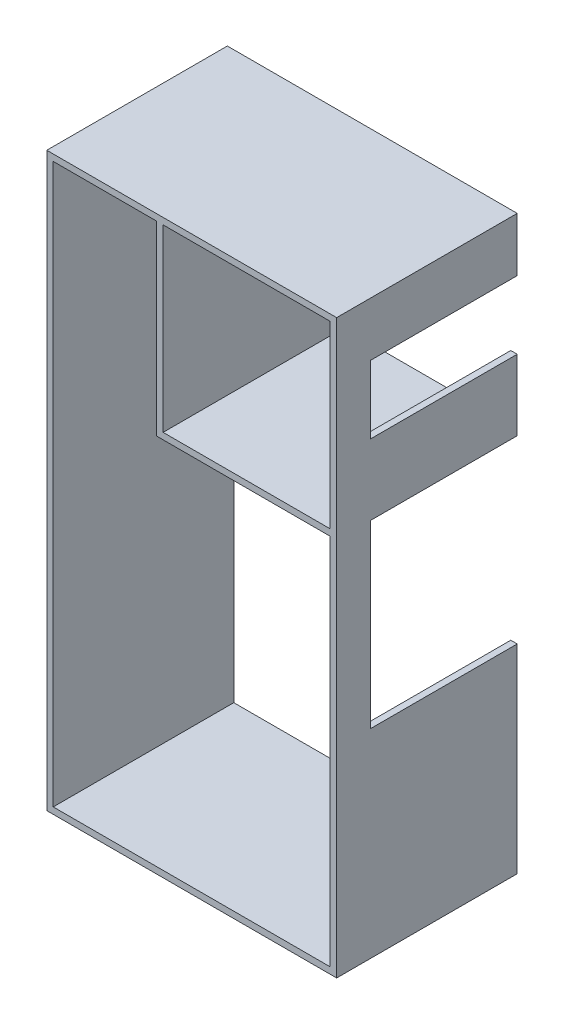
ISO-10303-21;
HEADER;
FILE_DESCRIPTION(('STEP AP214'),'2;1');
FILE_NAME('part.step','',(''),(''),'','','');
FILE_SCHEMA(('AUTOMOTIVE_DESIGN { 1 0 10303 214 1 1 1 1 }'));
ENDSEC;
DATA;
#1=APPLICATION_CONTEXT('core data for automotive mechanical design processes');
#2=APPLICATION_PROTOCOL_DEFINITION('international standard','automotive_design',2000,#1);
#3=PRODUCT_CONTEXT('',#1,'mechanical');
#4=PRODUCT('Part','Part','',(#3));
#5=PRODUCT_RELATED_PRODUCT_CATEGORY('part','',(#4));
#6=PRODUCT_DEFINITION_FORMATION('','',#4);
#7=PRODUCT_DEFINITION_CONTEXT('part definition',#1,'design');
#8=PRODUCT_DEFINITION('design','',#6,#7);
#9=PRODUCT_DEFINITION_SHAPE('','',#8);
#10=(LENGTH_UNIT() NAMED_UNIT(*) SI_UNIT(.MILLI.,.METRE.));
#11=(NAMED_UNIT(*) PLANE_ANGLE_UNIT() SI_UNIT($,.RADIAN.));
#12=(NAMED_UNIT(*) SI_UNIT($,.STERADIAN.) SOLID_ANGLE_UNIT());
#13=UNCERTAINTY_MEASURE_WITH_UNIT(LENGTH_MEASURE(1.E-05),#10,'distance_accuracy_value','');
#14=(GEOMETRIC_REPRESENTATION_CONTEXT(3) GLOBAL_UNCERTAINTY_ASSIGNED_CONTEXT((#13)) GLOBAL_UNIT_ASSIGNED_CONTEXT((#10,
#11,#12)) REPRESENTATION_CONTEXT('',''));
#15=CARTESIAN_POINT('',(0.,0.,0.));
#16=DIRECTION('',(0.,0.,1.));
#17=DIRECTION('',(1.,0.,0.));
#18=AXIS2_PLACEMENT_3D('',#15,#16,#17);
#19=CARTESIAN_POINT('',(-29656.4025133184,0.,41671.7001960568));
#20=DIRECTION('',(1.,0.,0.));
#21=DIRECTION('',(0.,0.,-1.));
#22=AXIS2_PLACEMENT_3D('',#19,#20,#21);
#23=PLANE('',#22);
#24=DIRECTION('',(0.,0.,1.));
#25=VECTOR('',#24,1.);
#26=CARTESIAN_POINT('',(-29656.4025133184,10080.7536432934,41671.7001960568));
#27=LINE('',#26,#25);
#28=CARTESIAN_POINT('',(-29656.4025133184,10080.7536432934,41150.2646912607));
#29=VERTEX_POINT('',#28);
#30=CARTESIAN_POINT('',(-29656.4025133184,10080.7536432934,41671.7001960568));
#31=VERTEX_POINT('',#30);
#32=EDGE_CURVE('E291',#29,#31,#27,.T.);
#33=ORIENTED_EDGE('',*,*,#32,.F.);
#34=DIRECTION('',(0.,-1.,0.));
#35=VECTOR('',#34,1.);
#36=CARTESIAN_POINT('',(-29656.4025133184,0.,41150.2646912607));
#37=LINE('',#36,#35);
#38=CARTESIAN_POINT('',(-29656.4025133184,7285.00682802414,41150.2646912607));
#39=VERTEX_POINT('',#38);
#40=EDGE_CURVE('E378',#29,#39,#37,.T.);
#41=ORIENTED_EDGE('',*,*,#40,.T.);
#42=DIRECTION('',(0.,0.,-1.));
#43=VECTOR('',#42,1.);
#44=CARTESIAN_POINT('',(-29656.4025133184,7285.00682802414,41671.7001960568));
#45=LINE('',#44,#43);
#46=CARTESIAN_POINT('',(-29656.4025133184,7285.00682802414,38871.7001960568));
#47=VERTEX_POINT('',#46);
#48=EDGE_CURVE('E375',#39,#47,#45,.T.);
#49=ORIENTED_EDGE('',*,*,#48,.T.);
#50=DIRECTION('',(0.,-1.,0.));
#51=VECTOR('',#50,1.);
#52=CARTESIAN_POINT('',(-29656.4025133184,0.,38871.7001960568));
#53=LINE('',#52,#51);
#54=CARTESIAN_POINT('',(-29656.4025133184,4298.5625694867,38871.7001960568));
#55=VERTEX_POINT('',#54);
#56=EDGE_CURVE('E323',#47,#55,#53,.T.);
#57=ORIENTED_EDGE('',*,*,#56,.T.);
#58=DIRECTION('',(0.,0.,-1.));
#59=VECTOR('',#58,1.);
#60=CARTESIAN_POINT('',(-29656.4025133184,4298.5625694867,41671.7001960568));
#61=LINE('',#60,#59);
#62=CARTESIAN_POINT('',(-29656.4025133184,4298.5625694867,41671.7001960568));
#63=VERTEX_POINT('',#62);
#64=EDGE_CURVE('E336',#63,#55,#61,.T.);
#65=ORIENTED_EDGE('',*,*,#64,.F.);
#66=DIRECTION('',(0.,-1.,0.));
#67=VECTOR('',#66,1.);
#68=CARTESIAN_POINT('',(-29656.4025133184,0.,41671.7001960568));
#69=LINE('',#68,#67);
#70=EDGE_CURVE('E108',#31,#63,#69,.T.);
#71=ORIENTED_EDGE('',*,*,#70,.F.);
#72=EDGE_LOOP('',(#33,#41,#49,#57,#65,#71));
#73=FACE_BOUND('',#72,.T.);
#74=ADVANCED_FACE('F85',(#73),#23,.F.);
#75=CARTESIAN_POINT('',(0.,12967.481366586,41671.7001960568));
#76=DIRECTION('',(0.,1.,0.));
#77=DIRECTION('',(0.,0.,1.));
#78=AXIS2_PLACEMENT_3D('',#75,#76,#77);
#79=PLANE('',#78);
#80=DIRECTION('',(0.,0.,-1.));
#81=VECTOR('',#80,1.);
#82=CARTESIAN_POINT('',(-32347.6899606535,12967.481366586,41671.7001960568));
#83=LINE('',#82,#81);
#84=CARTESIAN_POINT('',(-32347.6899606535,12967.481366586,41671.7001960568));
#85=VERTEX_POINT('',#84);
#86=CARTESIAN_POINT('',(-32347.6899606535,12967.481366586,38871.7001960568));
#87=VERTEX_POINT('',#86);
#88=EDGE_CURVE('E383',#85,#87,#83,.T.);
#89=ORIENTED_EDGE('',*,*,#88,.F.);
#90=DIRECTION('',(1.,0.,0.));
#91=VECTOR('',#90,1.);
#92=CARTESIAN_POINT('',(0.,12967.481366586,41671.7001960568));
#93=LINE('',#92,#91);
#94=CARTESIAN_POINT('',(-33951.6176832913,12967.481366586,41671.7001960568));
#95=VERTEX_POINT('',#94);
#96=EDGE_CURVE('E314',#95,#85,#93,.T.);
#97=ORIENTED_EDGE('',*,*,#96,.F.);
#98=DIRECTION('',(0.,0.,-1.));
#99=VECTOR('',#98,1.);
#100=CARTESIAN_POINT('',(-33951.6176832913,12967.481366586,41671.7001960568));
#101=LINE('',#100,#99);
#102=CARTESIAN_POINT('',(-33951.6176832913,12967.481366586,38871.7001960568));
#103=VERTEX_POINT('',#102);
#104=EDGE_CURVE('E317',#95,#103,#101,.T.);
#105=ORIENTED_EDGE('',*,*,#104,.T.);
#106=DIRECTION('',(1.,0.,0.));
#107=VECTOR('',#106,1.);
#108=CARTESIAN_POINT('',(0.,12967.481366586,38871.7001960568));
#109=LINE('',#108,#107);
#110=EDGE_CURVE('E307',#103,#87,#109,.T.);
#111=ORIENTED_EDGE('',*,*,#110,.T.);
#112=EDGE_LOOP('',(#89,#97,#105,#111));
#113=FACE_BOUND('',#112,.T.);
#114=ADVANCED_FACE('F424',(#113),#79,.F.);
#115=CARTESIAN_POINT('',(-29826.4025133184,0.,41150.2646912607));
#116=DIRECTION('',(0.,0.,1.));
#117=DIRECTION('',(1.,0.,0.));
#118=AXIS2_PLACEMENT_3D('',#115,#116,#117);
#119=PLANE('',#118);
#120=DIRECTION('',(-1.,0.,0.));
#121=VECTOR('',#120,1.);
#122=CARTESIAN_POINT('',(-29826.4025133184,10080.7536432934,41150.2646912607));
#123=LINE('',#122,#121);
#124=CARTESIAN_POINT('',(-29556.4025133184,10080.7536432934,41150.2646912607));
#125=VERTEX_POINT('',#124);
#126=EDGE_CURVE('E380',#125,#29,#123,.T.);
#127=ORIENTED_EDGE('',*,*,#126,.F.);
#128=DIRECTION('',(0.,-1.,0.));
#129=VECTOR('',#128,1.);
#130=CARTESIAN_POINT('',(-29556.4025133184,0.,41150.2646912607));
#131=LINE('',#130,#129);
#132=CARTESIAN_POINT('',(-29556.4025133184,7285.00682802414,41150.2646912607));
#133=VERTEX_POINT('',#132);
#134=EDGE_CURVE('E293',#125,#133,#131,.T.);
#135=ORIENTED_EDGE('',*,*,#134,.T.);
#136=DIRECTION('',(1.,0.,0.));
#137=VECTOR('',#136,1.);
#138=CARTESIAN_POINT('',(-29826.4025133184,7285.00682802414,41150.2646912607));
#139=LINE('',#138,#137);
#140=EDGE_CURVE('E297',#39,#133,#139,.T.);
#141=ORIENTED_EDGE('',*,*,#140,.F.);
#142=ORIENTED_EDGE('',*,*,#40,.F.);
#143=EDGE_LOOP('',(#127,#135,#141,#142));
#144=FACE_BOUND('',#143,.T.);
#145=ADVANCED_FACE('F464',(#144),#119,.F.);
#146=CARTESIAN_POINT('',(0.,0.,38871.7001960568));
#147=DIRECTION('',(0.,0.,1.));
#148=DIRECTION('',(1.,0.,0.));
#149=AXIS2_PLACEMENT_3D('',#146,#147,#148);
#150=PLANE('',#149);
#151=DIRECTION('',(0.,-1.,0.));
#152=VECTOR('',#151,1.);
#153=CARTESIAN_POINT('',(-29556.4025133184,0.,38871.7001960568));
#154=LINE('',#153,#152);
#155=CARTESIAN_POINT('',(-29556.4025133184,13067.481366586,38871.7001960568));
#156=VERTEX_POINT('',#155);
#157=CARTESIAN_POINT('',(-29556.4025133184,12230.8473890307,38871.7001960568));
#158=VERTEX_POINT('',#157);
#159=EDGE_CURVE('E361',#156,#158,#154,.T.);
#160=ORIENTED_EDGE('',*,*,#159,.T.);
#161=DIRECTION('',(1.,0.,0.));
#162=VECTOR('',#161,1.);
#163=CARTESIAN_POINT('',(-29696.4025133184,12230.8473890307,38871.7001960568));
#164=LINE('',#163,#162);
#165=CARTESIAN_POINT('',(-29656.4025133184,12230.8473890307,38871.7001960568));
#166=VERTEX_POINT('',#165);
#167=EDGE_CURVE('E254',#166,#158,#164,.T.);
#168=ORIENTED_EDGE('',*,*,#167,.F.);
#169=CARTESIAN_POINT('',(-29656.4025133184,12967.481366586,38871.7001960568));
#170=VERTEX_POINT('',#169);
#171=EDGE_CURVE('E324',#170,#166,#53,.T.);
#172=ORIENTED_EDGE('',*,*,#171,.F.);
#173=CARTESIAN_POINT('',(-32247.6899606535,12967.481366586,38871.7001960568));
#174=VERTEX_POINT('',#173);
#175=EDGE_CURVE('E327',#174,#170,#109,.T.);
#176=ORIENTED_EDGE('',*,*,#175,.F.);
#177=DIRECTION('',(0.,-1.,0.));
#178=VECTOR('',#177,1.);
#179=CARTESIAN_POINT('',(-32247.6899606535,0.,38871.7001960568));
#180=LINE('',#179,#178);
#181=CARTESIAN_POINT('',(-32247.6899606535,10180.7536432934,38871.7001960568));
#182=VERTEX_POINT('',#181);
#183=EDGE_CURVE('E264',#174,#182,#180,.T.);
#184=ORIENTED_EDGE('',*,*,#183,.T.);
#185=DIRECTION('',(1.,0.,0.));
#186=VECTOR('',#185,1.);
#187=CARTESIAN_POINT('',(0.,10180.7536432934,38871.7001960568));
#188=LINE('',#187,#186);
#189=CARTESIAN_POINT('',(-29656.4025133184,10180.7536432934,38871.7001960568));
#190=VERTEX_POINT('',#189);
#191=EDGE_CURVE('E267',#182,#190,#188,.T.);
#192=ORIENTED_EDGE('',*,*,#191,.T.);
#193=CARTESIAN_POINT('',(-29656.4025133184,11175.8565330266,38871.7001960568));
#194=VERTEX_POINT('',#193);
#195=EDGE_CURVE('E328',#194,#190,#53,.T.);
#196=ORIENTED_EDGE('',*,*,#195,.F.);
#197=DIRECTION('',(1.,0.,0.));
#198=VECTOR('',#197,1.);
#199=CARTESIAN_POINT('',(-29696.4025133184,11175.8565330266,38871.7001960568));
#200=LINE('',#199,#198);
#201=CARTESIAN_POINT('',(-29556.4025133184,11175.8565330266,38871.7001960568));
#202=VERTEX_POINT('',#201);
#203=EDGE_CURVE('E100',#194,#202,#200,.T.);
#204=ORIENTED_EDGE('',*,*,#203,.T.);
#205=CARTESIAN_POINT('',(-29556.4025133184,10080.7536432934,38871.7001960568));
#206=VERTEX_POINT('',#205);
#207=EDGE_CURVE('E248',#202,#206,#154,.T.);
#208=ORIENTED_EDGE('',*,*,#207,.T.);
#209=DIRECTION('',(1.,0.,0.));
#210=VECTOR('',#209,1.);
#211=CARTESIAN_POINT('',(-29556.4025133184,10080.7536432934,38871.7001960568));
#212=LINE('',#211,#210);
#213=CARTESIAN_POINT('',(-32347.6899606535,10080.7536432934,38871.7001960568));
#214=VERTEX_POINT('',#213);
#215=EDGE_CURVE('E280',#214,#206,#212,.T.);
#216=ORIENTED_EDGE('',*,*,#215,.F.);
#217=DIRECTION('',(0.,-1.,0.));
#218=VECTOR('',#217,1.);
#219=CARTESIAN_POINT('',(-32347.6899606535,13067.481366586,38871.7001960568));
#220=LINE('',#219,#218);
#221=EDGE_CURVE('E278',#87,#214,#220,.T.);
#222=ORIENTED_EDGE('',*,*,#221,.F.);
#223=ORIENTED_EDGE('',*,*,#110,.F.);
#224=DIRECTION('',(0.,-1.,0.));
#225=VECTOR('',#224,1.);
#226=CARTESIAN_POINT('',(-33951.6176832913,0.,38871.7001960568));
#227=LINE('',#226,#225);
#228=CARTESIAN_POINT('',(-33951.6176832913,4298.5625694867,38871.7001960568));
#229=VERTEX_POINT('',#228);
#230=EDGE_CURVE('E301',#103,#229,#227,.T.);
#231=ORIENTED_EDGE('',*,*,#230,.T.);
#232=DIRECTION('',(1.,0.,0.));
#233=VECTOR('',#232,1.);
#234=CARTESIAN_POINT('',(0.,4298.5625694867,38871.7001960568));
#235=LINE('',#234,#233);
#236=EDGE_CURVE('E320',#229,#55,#235,.T.);
#237=ORIENTED_EDGE('',*,*,#236,.T.);
#238=ORIENTED_EDGE('',*,*,#56,.F.);
#239=DIRECTION('',(1.,0.,0.));
#240=VECTOR('',#239,1.);
#241=CARTESIAN_POINT('',(-29826.4025133184,7285.00682802414,38871.7001960568));
#242=LINE('',#241,#240);
#243=CARTESIAN_POINT('',(-29556.4025133184,7285.00682802414,38871.7001960568));
#244=VERTEX_POINT('',#243);
#245=EDGE_CURVE('E298',#47,#244,#242,.T.);
#246=ORIENTED_EDGE('',*,*,#245,.T.);
#247=CARTESIAN_POINT('',(-29556.4025133184,4198.56256948671,38871.7001960568));
#248=VERTEX_POINT('',#247);
#249=EDGE_CURVE('E360',#244,#248,#154,.T.);
#250=ORIENTED_EDGE('',*,*,#249,.T.);
#251=DIRECTION('',(1.,0.,0.));
#252=VECTOR('',#251,1.);
#253=CARTESIAN_POINT('',(0.,4198.56256948671,38871.7001960568));
#254=LINE('',#253,#252);
#255=CARTESIAN_POINT('',(-34051.6176832913,4198.56256948671,38871.7001960568));
#256=VERTEX_POINT('',#255);
#257=EDGE_CURVE('E357',#256,#248,#254,.T.);
#258=ORIENTED_EDGE('',*,*,#257,.F.);
#259=DIRECTION('',(0.,-1.,0.));
#260=VECTOR('',#259,1.);
#261=CARTESIAN_POINT('',(-34051.6176832913,0.,38871.7001960568));
#262=LINE('',#261,#260);
#263=CARTESIAN_POINT('',(-34051.6176832913,13067.481366586,38871.7001960568));
#264=VERTEX_POINT('',#263);
#265=EDGE_CURVE('E342',#264,#256,#262,.T.);
#266=ORIENTED_EDGE('',*,*,#265,.F.);
#267=DIRECTION('',(1.,0.,0.));
#268=VECTOR('',#267,1.);
#269=CARTESIAN_POINT('',(0.,13067.481366586,38871.7001960568));
#270=LINE('',#269,#268);
#271=EDGE_CURVE('E347',#264,#156,#270,.T.);
#272=ORIENTED_EDGE('',*,*,#271,.T.);
#273=EDGE_LOOP('',(#160,#168,#172,#176,#184,#192,#196,#204,#208,#216,#222,#223,#231,#237,#238,
#246,#250,#258,#266,#272));
#274=FACE_BOUND('',#273,.T.);
#275=ADVANCED_FACE('F394',(#274),#150,.F.);
#276=CARTESIAN_POINT('',(-29556.4025133184,0.,41671.7001960568));
#277=DIRECTION('',(1.,0.,0.));
#278=DIRECTION('',(0.,0.,-1.));
#279=AXIS2_PLACEMENT_3D('',#276,#277,#278);
#280=PLANE('',#279);
#281=DIRECTION('',(0.,0.,1.));
#282=VECTOR('',#281,1.);
#283=CARTESIAN_POINT('',(-29556.4025133184,12230.8473890307,41150.2646912607));
#284=LINE('',#283,#282);
#285=CARTESIAN_POINT('',(-29556.4025133184,12230.8473890307,41150.2646912607));
#286=VERTEX_POINT('',#285);
#287=EDGE_CURVE('E234',#158,#286,#284,.T.);
#288=ORIENTED_EDGE('',*,*,#287,.F.);
#289=ORIENTED_EDGE('',*,*,#159,.F.);
#290=DIRECTION('',(0.,0.,-1.));
#291=VECTOR('',#290,1.);
#292=CARTESIAN_POINT('',(-29556.4025133184,13067.481366586,41671.7001960568));
#293=LINE('',#292,#291);
#294=CARTESIAN_POINT('',(-29556.4025133184,13067.481366586,41671.7001960568));
#295=VERTEX_POINT('',#294);
#296=EDGE_CURVE('E366',#295,#156,#293,.T.);
#297=ORIENTED_EDGE('',*,*,#296,.F.);
#298=DIRECTION('',(0.,-1.,0.));
#299=VECTOR('',#298,1.);
#300=CARTESIAN_POINT('',(-29556.4025133184,0.,41671.7001960568));
#301=LINE('',#300,#299);
#302=CARTESIAN_POINT('',(-29556.4025133184,4198.56256948671,41671.7001960568));
#303=VERTEX_POINT('',#302);
#304=EDGE_CURVE('E350',#295,#303,#301,.T.);
#305=ORIENTED_EDGE('',*,*,#304,.T.);
#306=DIRECTION('',(0.,0.,-1.));
#307=VECTOR('',#306,1.);
#308=CARTESIAN_POINT('',(-29556.4025133184,4198.56256948671,41671.7001960568));
#309=LINE('',#308,#307);
#310=EDGE_CURVE('E369',#303,#248,#309,.T.);
#311=ORIENTED_EDGE('',*,*,#310,.T.);
#312=ORIENTED_EDGE('',*,*,#249,.F.);
#313=DIRECTION('',(0.,0.,-1.));
#314=VECTOR('',#313,1.);
#315=CARTESIAN_POINT('',(-29556.4025133184,7285.00682802414,0.));
#316=LINE('',#315,#314);
#317=EDGE_CURVE('E295',#133,#244,#316,.T.);
#318=ORIENTED_EDGE('',*,*,#317,.F.);
#319=ORIENTED_EDGE('',*,*,#134,.F.);
#320=DIRECTION('',(0.,0.,-1.));
#321=VECTOR('',#320,1.);
#322=CARTESIAN_POINT('',(-29556.4025133184,10080.7536432934,45759.7104830712));
#323=LINE('',#322,#321);
#324=EDGE_CURVE('E283',#125,#206,#323,.T.);
#325=ORIENTED_EDGE('',*,*,#324,.T.);
#326=ORIENTED_EDGE('',*,*,#207,.F.);
#327=DIRECTION('',(0.,0.,-1.));
#328=VECTOR('',#327,1.);
#329=CARTESIAN_POINT('',(-29556.4025133184,11175.8565330266,41150.2646912607));
#330=LINE('',#329,#328);
#331=CARTESIAN_POINT('',(-29556.4025133184,11175.8565330266,41150.2646912607));
#332=VERTEX_POINT('',#331);
#333=EDGE_CURVE('E230',#332,#202,#330,.T.);
#334=ORIENTED_EDGE('',*,*,#333,.F.);
#335=DIRECTION('',(0.,-1.,0.));
#336=VECTOR('',#335,1.);
#337=CARTESIAN_POINT('',(-29556.4025133184,11175.8565330266,41150.2646912607));
#338=LINE('',#337,#336);
#339=EDGE_CURVE('E237',#286,#332,#338,.T.);
#340=ORIENTED_EDGE('',*,*,#339,.F.);
#341=EDGE_LOOP('',(#288,#289,#297,#305,#311,#312,#318,#319,#325,#326,#334,#340));
#342=FACE_BOUND('',#341,.T.);
#343=ADVANCED_FACE('F246',(#342),#280,.T.);
#344=ORIENTED_EDGE('',*,*,#171,.T.);
#345=DIRECTION('',(0.,0.,1.));
#346=VECTOR('',#345,1.);
#347=CARTESIAN_POINT('',(-29656.4025133184,12230.8473890307,41671.7001960568));
#348=LINE('',#347,#346);
#349=CARTESIAN_POINT('',(-29656.4025133184,12230.8473890307,41150.2646912607));
#350=VERTEX_POINT('',#349);
#351=EDGE_CURVE('E12',#166,#350,#348,.T.);
#352=ORIENTED_EDGE('',*,*,#351,.T.);
#353=DIRECTION('',(0.,-1.,0.));
#354=VECTOR('',#353,1.);
#355=CARTESIAN_POINT('',(-29656.4025133184,0.,41150.2646912607));
#356=LINE('',#355,#354);
#357=CARTESIAN_POINT('',(-29656.4025133184,11175.8565330266,41150.2646912607));
#358=VERTEX_POINT('',#357);
#359=EDGE_CURVE('E93',#350,#358,#356,.T.);
#360=ORIENTED_EDGE('',*,*,#359,.T.);
#361=DIRECTION('',(0.,0.,-1.));
#362=VECTOR('',#361,1.);
#363=CARTESIAN_POINT('',(-29656.4025133184,11175.8565330266,41671.7001960568));
#364=LINE('',#363,#362);
#365=EDGE_CURVE('E231',#358,#194,#364,.T.);
#366=ORIENTED_EDGE('',*,*,#365,.T.);
#367=ORIENTED_EDGE('',*,*,#195,.T.);
#368=DIRECTION('',(0.,0.,-1.));
#369=VECTOR('',#368,1.);
#370=CARTESIAN_POINT('',(-29656.4025133184,10180.7536432934,45759.7104830712));
#371=LINE('',#370,#369);
#372=CARTESIAN_POINT('',(-29656.4025133184,10180.7536432934,41671.7001960568));
#373=VERTEX_POINT('',#372);
#374=EDGE_CURVE('E270',#373,#190,#371,.T.);
#375=ORIENTED_EDGE('',*,*,#374,.F.);
#376=CARTESIAN_POINT('',(-29656.4025133184,12967.481366586,41671.7001960568));
#377=VERTEX_POINT('',#376);
#378=EDGE_CURVE('E310',#377,#373,#69,.T.);
#379=ORIENTED_EDGE('',*,*,#378,.F.);
#380=DIRECTION('',(0.,0.,-1.));
#381=VECTOR('',#380,1.);
#382=CARTESIAN_POINT('',(-29656.4025133184,12967.481366586,41671.7001960568));
#383=LINE('',#382,#381);
#384=EDGE_CURVE('E333',#377,#170,#383,.T.);
#385=ORIENTED_EDGE('',*,*,#384,.T.);
#386=EDGE_LOOP('',(#344,#352,#360,#366,#367,#375,#379,#385));
#387=FACE_BOUND('',#386,.T.);
#388=ADVANCED_FACE('F386',(#387),#23,.F.);
#389=CARTESIAN_POINT('',(0.,0.,41671.7001960568));
#390=DIRECTION('',(0.,0.,1.));
#391=DIRECTION('',(1.,0.,0.));
#392=AXIS2_PLACEMENT_3D('',#389,#390,#391);
#393=PLANE('',#392);
#394=DIRECTION('',(1.,0.,0.));
#395=VECTOR('',#394,1.);
#396=CARTESIAN_POINT('',(-29556.4025133184,10080.7536432934,41671.7001960568));
#397=LINE('',#396,#395);
#398=CARTESIAN_POINT('',(-32347.6899606535,10080.7536432934,41671.7001960568));
#399=VERTEX_POINT('',#398);
#400=EDGE_CURVE('E259',#399,#31,#397,.T.);
#401=ORIENTED_EDGE('',*,*,#400,.T.);
#402=ORIENTED_EDGE('',*,*,#70,.T.);
#403=DIRECTION('',(1.,0.,0.));
#404=VECTOR('',#403,1.);
#405=CARTESIAN_POINT('',(0.,4298.5625694867,41671.7001960568));
#406=LINE('',#405,#404);
#407=CARTESIAN_POINT('',(-33951.6176832913,4298.5625694867,41671.7001960568));
#408=VERTEX_POINT('',#407);
#409=EDGE_CURVE('E306',#408,#63,#406,.T.);
#410=ORIENTED_EDGE('',*,*,#409,.F.);
#411=DIRECTION('',(0.,-1.,0.));
#412=VECTOR('',#411,1.);
#413=CARTESIAN_POINT('',(-33951.6176832913,0.,41671.7001960568));
#414=LINE('',#413,#412);
#415=EDGE_CURVE('E304',#95,#408,#414,.T.);
#416=ORIENTED_EDGE('',*,*,#415,.F.);
#417=ORIENTED_EDGE('',*,*,#96,.T.);
#418=DIRECTION('',(0.,-1.,0.));
#419=VECTOR('',#418,1.);
#420=CARTESIAN_POINT('',(-32347.6899606535,13067.481366586,41671.7001960568));
#421=LINE('',#420,#419);
#422=EDGE_CURVE('E262',#85,#399,#421,.T.);
#423=ORIENTED_EDGE('',*,*,#422,.T.);
#424=EDGE_LOOP('',(#401,#402,#410,#416,#417,#423));
#425=FACE_BOUND('',#424,.T.);
#426=ORIENTED_EDGE('',*,*,#378,.T.);
#427=DIRECTION('',(1.,0.,0.));
#428=VECTOR('',#427,1.);
#429=CARTESIAN_POINT('',(0.,10180.7536432934,41671.7001960568));
#430=LINE('',#429,#428);
#431=CARTESIAN_POINT('',(-32247.6899606535,10180.7536432934,41671.7001960568));
#432=VERTEX_POINT('',#431);
#433=EDGE_CURVE('E288',#432,#373,#430,.T.);
#434=ORIENTED_EDGE('',*,*,#433,.F.);
#435=DIRECTION('',(0.,-1.,0.));
#436=VECTOR('',#435,1.);
#437=CARTESIAN_POINT('',(-32247.6899606535,0.,41671.7001960568));
#438=LINE('',#437,#436);
#439=CARTESIAN_POINT('',(-32247.6899606535,12967.481366586,41671.7001960568));
#440=VERTEX_POINT('',#439);
#441=EDGE_CURVE('E253',#440,#432,#438,.T.);
#442=ORIENTED_EDGE('',*,*,#441,.F.);
#443=EDGE_CURVE('E313',#440,#377,#93,.T.);
#444=ORIENTED_EDGE('',*,*,#443,.T.);
#445=EDGE_LOOP('',(#426,#434,#442,#444));
#446=FACE_BOUND('',#445,.T.);
#447=DIRECTION('',(1.,0.,0.));
#448=VECTOR('',#447,1.);
#449=CARTESIAN_POINT('',(0.,4198.56256948671,41671.7001960568));
#450=LINE('',#449,#448);
#451=CARTESIAN_POINT('',(-34051.6176832913,4198.56256948671,41671.7001960568));
#452=VERTEX_POINT('',#451);
#453=EDGE_CURVE('E346',#452,#303,#450,.T.);
#454=ORIENTED_EDGE('',*,*,#453,.T.);
#455=ORIENTED_EDGE('',*,*,#304,.F.);
#456=DIRECTION('',(1.,0.,0.));
#457=VECTOR('',#456,1.);
#458=CARTESIAN_POINT('',(0.,13067.481366586,41671.7001960568));
#459=LINE('',#458,#457);
#460=CARTESIAN_POINT('',(-34051.6176832913,13067.481366586,41671.7001960568));
#461=VERTEX_POINT('',#460);
#462=EDGE_CURVE('E352',#461,#295,#459,.T.);
#463=ORIENTED_EDGE('',*,*,#462,.F.);
#464=DIRECTION('',(0.,-1.,0.));
#465=VECTOR('',#464,1.);
#466=CARTESIAN_POINT('',(-34051.6176832913,0.,41671.7001960568));
#467=LINE('',#466,#465);
#468=EDGE_CURVE('E343',#461,#452,#467,.T.);
#469=ORIENTED_EDGE('',*,*,#468,.T.);
#470=EDGE_LOOP('',(#454,#455,#463,#469));
#471=FACE_BOUND('',#470,.T.);
#472=ADVANCED_FACE('F403',(#425,#446,#471),#393,.T.);
#473=CARTESIAN_POINT('',(-34051.6176832913,0.,41671.7001960568));
#474=DIRECTION('',(1.,0.,0.));
#475=DIRECTION('',(0.,0.,-1.));
#476=AXIS2_PLACEMENT_3D('',#473,#474,#475);
#477=PLANE('',#476);
#478=ORIENTED_EDGE('',*,*,#265,.T.);
#479=DIRECTION('',(0.,0.,-1.));
#480=VECTOR('',#479,1.);
#481=CARTESIAN_POINT('',(-34051.6176832913,4198.56256948671,41671.7001960568));
#482=LINE('',#481,#480);
#483=EDGE_CURVE('E372',#452,#256,#482,.T.);
#484=ORIENTED_EDGE('',*,*,#483,.F.);
#485=ORIENTED_EDGE('',*,*,#468,.F.);
#486=DIRECTION('',(0.,0.,-1.));
#487=VECTOR('',#486,1.);
#488=CARTESIAN_POINT('',(-34051.6176832913,13067.481366586,41671.7001960568));
#489=LINE('',#488,#487);
#490=EDGE_CURVE('E354',#461,#264,#489,.T.);
#491=ORIENTED_EDGE('',*,*,#490,.T.);
#492=EDGE_LOOP('',(#478,#484,#485,#491));
#493=FACE_BOUND('',#492,.T.);
#494=ADVANCED_FACE('F87',(#493),#477,.F.);
#495=CARTESIAN_POINT('',(0.,4198.56256948671,41671.7001960568));
#496=DIRECTION('',(0.,1.,0.));
#497=DIRECTION('',(0.,0.,1.));
#498=AXIS2_PLACEMENT_3D('',#495,#496,#497);
#499=PLANE('',#498);
#500=ORIENTED_EDGE('',*,*,#257,.T.);
#501=ORIENTED_EDGE('',*,*,#310,.F.);
#502=ORIENTED_EDGE('',*,*,#453,.F.);
#503=ORIENTED_EDGE('',*,*,#483,.T.);
#504=EDGE_LOOP('',(#500,#501,#502,#503));
#505=FACE_BOUND('',#504,.T.);
#506=ADVANCED_FACE('F408',(#505),#499,.F.);
#507=CARTESIAN_POINT('',(0.,13067.481366586,41671.7001960568));
#508=DIRECTION('',(0.,1.,0.));
#509=DIRECTION('',(0.,0.,1.));
#510=AXIS2_PLACEMENT_3D('',#507,#508,#509);
#511=PLANE('',#510);
#512=ORIENTED_EDGE('',*,*,#296,.T.);
#513=ORIENTED_EDGE('',*,*,#271,.F.);
#514=ORIENTED_EDGE('',*,*,#490,.F.);
#515=ORIENTED_EDGE('',*,*,#462,.T.);
#516=EDGE_LOOP('',(#512,#513,#514,#515));
#517=FACE_BOUND('',#516,.T.);
#518=ADVANCED_FACE('F399',(#517),#511,.T.);
#519=CARTESIAN_POINT('',(-33951.6176832913,0.,41671.7001960568));
#520=DIRECTION('',(1.,0.,0.));
#521=DIRECTION('',(0.,0.,-1.));
#522=AXIS2_PLACEMENT_3D('',#519,#520,#521);
#523=PLANE('',#522);
#524=ORIENTED_EDGE('',*,*,#230,.F.);
#525=ORIENTED_EDGE('',*,*,#104,.F.);
#526=ORIENTED_EDGE('',*,*,#415,.T.);
#527=DIRECTION('',(0.,0.,-1.));
#528=VECTOR('',#527,1.);
#529=CARTESIAN_POINT('',(-33951.6176832913,4298.5625694867,41671.7001960568));
#530=LINE('',#529,#528);
#531=EDGE_CURVE('E339',#408,#229,#530,.T.);
#532=ORIENTED_EDGE('',*,*,#531,.T.);
#533=EDGE_LOOP('',(#524,#525,#526,#532));
#534=FACE_BOUND('',#533,.T.);
#535=ADVANCED_FACE('F428',(#534),#523,.T.);
#536=CARTESIAN_POINT('',(0.,4298.5625694867,41671.7001960568));
#537=DIRECTION('',(0.,1.,0.));
#538=DIRECTION('',(0.,0.,1.));
#539=AXIS2_PLACEMENT_3D('',#536,#537,#538);
#540=PLANE('',#539);
#541=ORIENTED_EDGE('',*,*,#236,.F.);
#542=ORIENTED_EDGE('',*,*,#531,.F.);
#543=ORIENTED_EDGE('',*,*,#409,.T.);
#544=ORIENTED_EDGE('',*,*,#64,.T.);
#545=EDGE_LOOP('',(#541,#542,#543,#544));
#546=FACE_BOUND('',#545,.T.);
#547=ADVANCED_FACE('F432',(#546),#540,.T.);
#548=ORIENTED_EDGE('',*,*,#443,.F.);
#549=DIRECTION('',(0.,0.,-1.));
#550=VECTOR('',#549,1.);
#551=CARTESIAN_POINT('',(-32247.6899606535,12967.481366586,45759.7104830712));
#552=LINE('',#551,#550);
#553=EDGE_CURVE('E275',#440,#174,#552,.T.);
#554=ORIENTED_EDGE('',*,*,#553,.T.);
#555=ORIENTED_EDGE('',*,*,#175,.T.);
#556=ORIENTED_EDGE('',*,*,#384,.F.);
#557=EDGE_LOOP('',(#548,#554,#555,#556));
#558=FACE_BOUND('',#557,.T.);
#559=ADVANCED_FACE('F446',(#558),#79,.F.);
#560=CARTESIAN_POINT('',(-29826.4025133184,7285.00682802414,0.));
#561=DIRECTION('',(0.,-1.,0.));
#562=DIRECTION('',(0.,0.,-1.));
#563=AXIS2_PLACEMENT_3D('',#560,#561,#562);
#564=PLANE('',#563);
#565=ORIENTED_EDGE('',*,*,#140,.T.);
#566=ORIENTED_EDGE('',*,*,#317,.T.);
#567=ORIENTED_EDGE('',*,*,#245,.F.);
#568=ORIENTED_EDGE('',*,*,#48,.F.);
#569=EDGE_LOOP('',(#565,#566,#567,#568));
#570=FACE_BOUND('',#569,.T.);
#571=ADVANCED_FACE('F489',(#570),#564,.F.);
#572=CARTESIAN_POINT('',(-29556.4025133184,10080.7536432934,45759.7104830712));
#573=DIRECTION('',(0.,1.,0.));
#574=DIRECTION('',(0.,0.,1.));
#575=AXIS2_PLACEMENT_3D('',#572,#573,#574);
#576=PLANE('',#575);
#577=ORIENTED_EDGE('',*,*,#126,.T.);
#578=ORIENTED_EDGE('',*,*,#32,.T.);
#579=ORIENTED_EDGE('',*,*,#400,.F.);
#580=DIRECTION('',(0.,0.,-1.));
#581=VECTOR('',#580,1.);
#582=CARTESIAN_POINT('',(-32347.6899606535,10080.7536432934,45759.7104830712));
#583=LINE('',#582,#581);
#584=EDGE_CURVE('E285',#399,#214,#583,.T.);
#585=ORIENTED_EDGE('',*,*,#584,.T.);
#586=ORIENTED_EDGE('',*,*,#215,.T.);
#587=ORIENTED_EDGE('',*,*,#324,.F.);
#588=EDGE_LOOP('',(#577,#578,#579,#585,#586,#587));
#589=FACE_BOUND('',#588,.T.);
#590=ADVANCED_FACE('F416',(#589),#576,.F.);
#591=CARTESIAN_POINT('',(-32247.6899606535,0.,45759.7104830712));
#592=DIRECTION('',(1.,0.,0.));
#593=DIRECTION('',(0.,0.,-1.));
#594=AXIS2_PLACEMENT_3D('',#591,#592,#593);
#595=PLANE('',#594);
#596=ORIENTED_EDGE('',*,*,#553,.F.);
#597=ORIENTED_EDGE('',*,*,#441,.T.);
#598=DIRECTION('',(0.,0.,-1.));
#599=VECTOR('',#598,1.);
#600=CARTESIAN_POINT('',(-32247.6899606535,10180.7536432934,45759.7104830712));
#601=LINE('',#600,#599);
#602=EDGE_CURVE('E273',#432,#182,#601,.T.);
#603=ORIENTED_EDGE('',*,*,#602,.T.);
#604=ORIENTED_EDGE('',*,*,#183,.F.);
#605=EDGE_LOOP('',(#596,#597,#603,#604));
#606=FACE_BOUND('',#605,.T.);
#607=ADVANCED_FACE('F442',(#606),#595,.T.);
#608=CARTESIAN_POINT('',(-32347.6899606535,13067.481366586,45759.7104830712));
#609=DIRECTION('',(1.,0.,0.));
#610=DIRECTION('',(0.,0.,-1.));
#611=AXIS2_PLACEMENT_3D('',#608,#609,#610);
#612=PLANE('',#611);
#613=ORIENTED_EDGE('',*,*,#422,.F.);
#614=ORIENTED_EDGE('',*,*,#88,.T.);
#615=ORIENTED_EDGE('',*,*,#221,.T.);
#616=ORIENTED_EDGE('',*,*,#584,.F.);
#617=EDGE_LOOP('',(#613,#614,#615,#616));
#618=FACE_BOUND('',#617,.T.);
#619=ADVANCED_FACE('F420',(#618),#612,.F.);
#620=CARTESIAN_POINT('',(0.,10180.7536432934,45759.7104830712));
#621=DIRECTION('',(0.,1.,0.));
#622=DIRECTION('',(0.,0.,1.));
#623=AXIS2_PLACEMENT_3D('',#620,#621,#622);
#624=PLANE('',#623);
#625=ORIENTED_EDGE('',*,*,#602,.F.);
#626=ORIENTED_EDGE('',*,*,#433,.T.);
#627=ORIENTED_EDGE('',*,*,#374,.T.);
#628=ORIENTED_EDGE('',*,*,#191,.F.);
#629=EDGE_LOOP('',(#625,#626,#627,#628));
#630=FACE_BOUND('',#629,.T.);
#631=ADVANCED_FACE('F439',(#630),#624,.T.);
#632=CARTESIAN_POINT('',(-29696.4025133184,11175.8565330266,41150.2646912607));
#633=DIRECTION('',(0.,0.,1.));
#634=DIRECTION('',(1.,0.,0.));
#635=AXIS2_PLACEMENT_3D('',#632,#633,#634);
#636=PLANE('',#635);
#637=DIRECTION('',(1.,0.,0.));
#638=VECTOR('',#637,1.);
#639=CARTESIAN_POINT('',(-29696.4025133184,12230.8473890307,41150.2646912607));
#640=LINE('',#639,#638);
#641=EDGE_CURVE('E240',#350,#286,#640,.T.);
#642=ORIENTED_EDGE('',*,*,#641,.T.);
#643=ORIENTED_EDGE('',*,*,#339,.T.);
#644=DIRECTION('',(1.,0.,0.));
#645=VECTOR('',#644,1.);
#646=CARTESIAN_POINT('',(-29696.4025133184,11175.8565330266,41150.2646912607));
#647=LINE('',#646,#645);
#648=EDGE_CURVE('E226',#358,#332,#647,.T.);
#649=ORIENTED_EDGE('',*,*,#648,.F.);
#650=ORIENTED_EDGE('',*,*,#359,.F.);
#651=EDGE_LOOP('',(#642,#643,#649,#650));
#652=FACE_BOUND('',#651,.T.);
#653=ADVANCED_FACE('F238',(#652),#636,.F.);
#654=CARTESIAN_POINT('',(-29696.4025133184,12230.8473890307,41150.2646912607));
#655=DIRECTION('',(0.,1.,0.));
#656=DIRECTION('',(0.,0.,1.));
#657=AXIS2_PLACEMENT_3D('',#654,#655,#656);
#658=PLANE('',#657);
#659=ORIENTED_EDGE('',*,*,#167,.T.);
#660=ORIENTED_EDGE('',*,*,#287,.T.);
#661=ORIENTED_EDGE('',*,*,#641,.F.);
#662=ORIENTED_EDGE('',*,*,#351,.F.);
#663=EDGE_LOOP('',(#659,#660,#661,#662));
#664=FACE_BOUND('',#663,.T.);
#665=ADVANCED_FACE('F389',(#664),#658,.F.);
#666=CARTESIAN_POINT('',(-29696.4025133184,11175.8565330266,41150.2646912607));
#667=DIRECTION('',(0.,-1.,0.));
#668=DIRECTION('',(0.,0.,-1.));
#669=AXIS2_PLACEMENT_3D('',#666,#667,#668);
#670=PLANE('',#669);
#671=ORIENTED_EDGE('',*,*,#648,.T.);
#672=ORIENTED_EDGE('',*,*,#333,.T.);
#673=ORIENTED_EDGE('',*,*,#203,.F.);
#674=ORIENTED_EDGE('',*,*,#365,.F.);
#675=EDGE_LOOP('',(#671,#672,#673,#674));
#676=FACE_BOUND('',#675,.T.);
#677=ADVANCED_FACE('F228',(#676),#670,.F.);
#678=CLOSED_SHELL('',(#74,#114,#145,#275,#343,#388,#472,#494,#506,#518,#535,#547,#559,#571,#590,
#607,#619,#631,#653,#665,#677));
#679=MANIFOLD_SOLID_BREP('B2',#678);
#680=ADVANCED_BREP_SHAPE_REPRESENTATION('',(#18,#679),#14);
#681=SHAPE_DEFINITION_REPRESENTATION(#9,#680);
ENDSEC;
END-ISO-10303-21;
